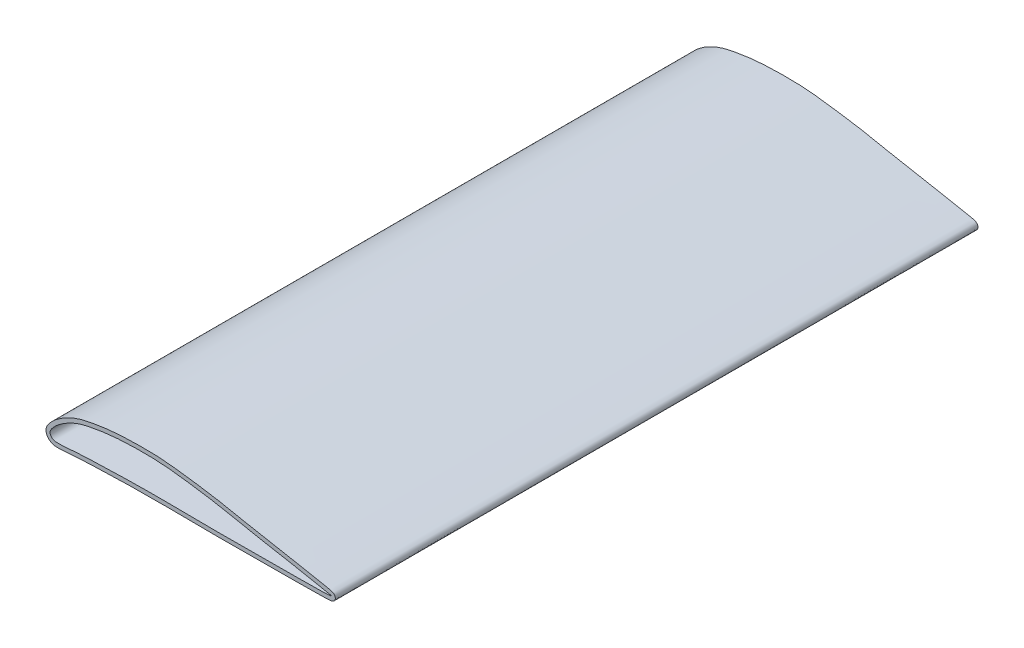
ISO-10303-21;
HEADER;
FILE_DESCRIPTION(('STEP AP214'),'2;1');
FILE_NAME('part.step','',(''),(''),'','','');
FILE_SCHEMA(('AUTOMOTIVE_DESIGN { 1 0 10303 214 1 1 1 1 }'));
ENDSEC;
DATA;
#1=APPLICATION_CONTEXT('core data for automotive mechanical design processes');
#2=APPLICATION_PROTOCOL_DEFINITION('international standard','automotive_design',2000,#1);
#3=PRODUCT_CONTEXT('',#1,'mechanical');
#4=PRODUCT('Part','Part','',(#3));
#5=PRODUCT_RELATED_PRODUCT_CATEGORY('part','',(#4));
#6=PRODUCT_DEFINITION_FORMATION('','',#4);
#7=PRODUCT_DEFINITION_CONTEXT('part definition',#1,'design');
#8=PRODUCT_DEFINITION('design','',#6,#7);
#9=PRODUCT_DEFINITION_SHAPE('','',#8);
#10=(LENGTH_UNIT() NAMED_UNIT(*) SI_UNIT(.MILLI.,.METRE.));
#11=(NAMED_UNIT(*) PLANE_ANGLE_UNIT() SI_UNIT($,.RADIAN.));
#12=(NAMED_UNIT(*) SI_UNIT($,.STERADIAN.) SOLID_ANGLE_UNIT());
#13=UNCERTAINTY_MEASURE_WITH_UNIT(LENGTH_MEASURE(1.E-05),#10,'distance_accuracy_value','');
#14=(GEOMETRIC_REPRESENTATION_CONTEXT(3) GLOBAL_UNCERTAINTY_ASSIGNED_CONTEXT((#13)) GLOBAL_UNIT_ASSIGNED_CONTEXT((#10,
#11,#12)) REPRESENTATION_CONTEXT('',''));
#15=CARTESIAN_POINT('',(0.,0.,0.));
#16=DIRECTION('',(0.,0.,1.));
#17=DIRECTION('',(1.,0.,0.));
#18=AXIS2_PLACEMENT_3D('',#15,#16,#17);
#19=CARTESIAN_POINT('',(-2.12770220526425,9.28546322944858,812.8));
#20=DIRECTION('',(0.,0.,-1.));
#21=DIRECTION('',(-1.,0.,0.));
#22=AXIS2_PLACEMENT_3D('',#19,#20,#21);
#23=PLANE('',#22);
#24=CARTESIAN_POINT('',(360.611783088414,-0.829716984691534,812.8));
#25=CARTESIAN_POINT('',(360.677516736931,-0.431769590755068,812.8));
#26=CARTESIAN_POINT('',(360.715012102294,0.39737776358076,812.8));
#27=CARTESIAN_POINT('',(360.421664380915,1.89734659052009,812.8));
#28=CARTESIAN_POINT('',(359.690517844514,3.17401205027613,812.8));
#29=CARTESIAN_POINT('',(358.918126768744,3.96508175282873,812.8));
#30=CARTESIAN_POINT('',(358.318267032827,4.42066290293129,812.8));
#31=CARTESIAN_POINT('',(357.843135950298,4.70927198930258,812.8));
#32=CARTESIAN_POINT('',(357.314769247348,4.98094514254315,812.8));
#33=CARTESIAN_POINT('',(356.769061674902,5.20760724953017,812.8));
#34=CARTESIAN_POINT('',(356.166361832082,5.41896649450408,812.8));
#35=CARTESIAN_POINT('',(355.564871973001,5.60295091670029,812.8));
#36=CARTESIAN_POINT('',(354.940172054753,5.77519661899665,812.8));
#37=CARTESIAN_POINT('',(354.062218077521,5.99777597210625,812.8));
#38=CARTESIAN_POINT('',(352.868144290553,6.27164418057462,812.8));
#39=CARTESIAN_POINT('',(351.281150812052,6.60345342509342,812.8));
#40=CARTESIAN_POINT('',(349.562200998619,6.93999659218324,812.8));
#41=CARTESIAN_POINT('',(347.7407484887,7.2805028361551,812.8));
#42=CARTESIAN_POINT('',(345.849846535147,7.62302316120932,812.8));
#43=CARTESIAN_POINT('',(343.284754246802,8.07888802212605,812.8));
#44=CARTESIAN_POINT('',(340.077278886889,8.64115010600491,812.8));
#45=CARTESIAN_POINT('',(336.581931789645,9.27338582575616,812.8));
#46=CARTESIAN_POINT('',(332.422020488974,10.0640645410946,812.8));
#47=CARTESIAN_POINT('',(327.903122178561,10.9777528968965,812.8));
#48=CARTESIAN_POINT('',(322.976471656021,12.0169837915886,812.8));
#49=CARTESIAN_POINT('',(317.864518336372,13.0643737721078,812.8));
#50=CARTESIAN_POINT('',(312.471448603847,14.1199230530068,812.8));
#51=CARTESIAN_POINT('',(306.892602428793,15.1792404595878,812.8));
#52=CARTESIAN_POINT('',(299.271359613369,16.5928128056946,812.8));
#53=CARTESIAN_POINT('',(289.539235870043,18.3555767649719,812.8));
#54=CARTESIAN_POINT('',(278.069145873182,20.4269138910801,812.8));
#55=CARTESIAN_POINT('',(266.889028325214,22.4813885575546,812.8));
#56=CARTESIAN_POINT('',(255.836169363417,24.5743857296795,812.8));
#57=CARTESIAN_POINT('',(241.119161142244,27.5041516765873,812.8));
#58=CARTESIAN_POINT('',(226.17771818306,30.6284955585057,812.8));
#59=CARTESIAN_POINT('',(211.073246752962,33.4503768288242,812.8));
#60=CARTESIAN_POINT('',(195.957402496639,35.9498185763177,812.8));
#61=CARTESIAN_POINT('',(177.127921344669,38.6597453231217,812.8));
#62=CARTESIAN_POINT('',(158.171643384304,41.2095808677918,812.8));
#63=CARTESIAN_POINT('',(142.799977726278,42.6172304733267,812.8));
#64=CARTESIAN_POINT('',(127.3617538442,43.4085128169304,812.8));
#65=CARTESIAN_POINT('',(111.9803158707,43.4046138855933,812.8));
#66=CARTESIAN_POINT('',(96.6348267084863,42.956517857911,812.8));
#67=CARTESIAN_POINT('',(85.0848707586515,42.3205909914167,812.8));
#68=CARTESIAN_POINT('',(73.531301514642,41.2765470192465,812.8));
#69=CARTESIAN_POINT('',(63.9313400403143,39.958908520291,812.8));
#70=CARTESIAN_POINT('',(56.3171155845465,38.6791030971168,812.8));
#71=CARTESIAN_POINT('',(50.6499497599874,37.6425202662996,812.8));
#72=CARTESIAN_POINT('',(44.9021633114431,36.4945120368245,812.8));
#73=CARTESIAN_POINT('',(39.1082915605699,35.0915992380378,812.8));
#74=CARTESIAN_POINT('',(33.2849324709737,33.2881291630142,812.8));
#75=CARTESIAN_POINT('',(27.6295600534796,30.9904600469647,812.8));
#76=CARTESIAN_POINT('',(22.2804118646765,28.4439820560217,812.8));
#77=CARTESIAN_POINT('',(17.0046326392783,25.6141861462535,812.8));
#78=CARTESIAN_POINT('',(11.8148958602526,22.3569422918749,812.8));
#79=CARTESIAN_POINT('',(7.67976623012431,19.2848085907363,812.8));
#80=CARTESIAN_POINT('',(4.59692601950477,16.635405025183,812.8));
#81=CARTESIAN_POINT('',(2.75896588536493,14.8760894966245,812.8));
#82=CARTESIAN_POINT('',(1.29550753139356,13.3542887541975,812.8));
#83=CARTESIAN_POINT('',(-0.163888759750838,11.7621121392498,812.8));
#84=CARTESIAN_POINT('',(-1.76422697415687,9.87346266874208,812.8));
#85=CARTESIAN_POINT('',(-3.25473722108047,7.6373019832347,812.8));
#86=CARTESIAN_POINT('',(-4.24628459349043,5.73495661624964,812.8));
#87=CARTESIAN_POINT('',(-5.00239928749968,3.53636937217703,812.8));
#88=CARTESIAN_POINT('',(-5.26736052713064,1.40326338643544,812.8));
#89=CARTESIAN_POINT('',(-5.12293710295604,-0.423499273381427,812.8));
#90=CARTESIAN_POINT('',(-4.69457004507471,-2.28179932337742,812.8));
#91=CARTESIAN_POINT('',(-3.75857745264617,-4.27625739479231,812.8));
#92=CARTESIAN_POINT('',(-2.25734351985861,-6.25985534644904,812.8));
#93=CARTESIAN_POINT('',(-0.464391315841216,-7.89542098064643,812.8));
#94=CARTESIAN_POINT('',(1.57959188809487,-9.2065616818801,812.8));
#95=CARTESIAN_POINT('',(3.94550239027525,-10.1218160695568,812.8));
#96=CARTESIAN_POINT('',(6.09493637855499,-10.5121842637663,812.8));
#97=CARTESIAN_POINT('',(7.97730648609706,-10.635362611475,812.8));
#98=CARTESIAN_POINT('',(9.51378006784479,-10.6559856217739,812.8));
#99=CARTESIAN_POINT('',(11.0416365883093,-10.6551970821441,812.8));
#100=CARTESIAN_POINT('',(12.5521230776529,-10.6243070079716,812.8));
#101=CARTESIAN_POINT('',(14.5465880708117,-10.5534600115824,812.8));
#102=CARTESIAN_POINT('',(17.0027877836702,-10.4174453262564,812.8));
#103=CARTESIAN_POINT('',(19.8949796055631,-10.2135180018431,812.8));
#104=CARTESIAN_POINT('',(22.7646933158898,-9.98881693717707,812.8));
#105=CARTESIAN_POINT('',(26.5530442008788,-9.67955193951272,812.8));
#106=CARTESIAN_POINT('',(31.2339877004447,-9.32155039401743,812.8));
#107=CARTESIAN_POINT('',(36.8687596815271,-8.95415187691269,812.8));
#108=CARTESIAN_POINT('',(42.5127093096359,-8.64234179615913,812.8));
#109=CARTESIAN_POINT('',(50.0612723083799,-8.28265032401868,812.8));
#110=CARTESIAN_POINT('',(59.5358879153629,-7.89049896565152,812.8));
#111=CARTESIAN_POINT('',(70.8921113057371,-7.47157703221145,812.8));
#112=CARTESIAN_POINT('',(82.2509482839475,-7.13095886237088,812.8));
#113=CARTESIAN_POINT('',(93.6164314430209,-6.85714543292889,812.8));
#114=CARTESIAN_POINT('',(108.778159596147,-6.57307460139264,812.8));
#115=CARTESIAN_POINT('',(127.732040417636,-6.33343496888481,812.8));
#116=CARTESIAN_POINT('',(150.425871859691,-6.39021215201501,812.8));
#117=CARTESIAN_POINT('',(173.21538765855,-6.75511670445447,812.8));
#118=CARTESIAN_POINT('',(196.045006315125,-6.93306279481234,812.8));
#119=CARTESIAN_POINT('',(218.881556020523,-6.93455837706369,812.8));
#120=CARTESIAN_POINT('',(237.963138188414,-6.84933351263652,812.8));
#121=CARTESIAN_POINT('',(253.08865728164,-6.71588183253142,812.8));
#122=CARTESIAN_POINT('',(264.367699993041,-6.59380460984213,812.8));
#123=CARTESIAN_POINT('',(275.720835372521,-6.48324674649998,812.8));
#124=CARTESIAN_POINT('',(287.295269893329,-6.41882566901398,812.8));
#125=CARTESIAN_POINT('',(297.162605658105,-6.41490960033031,812.8));
#126=CARTESIAN_POINT('',(304.922637869046,-6.40961902290395,812.8));
#127=CARTESIAN_POINT('',(310.619329753822,-6.39832852705022,812.8));
#128=CARTESIAN_POINT('',(316.140036270488,-6.37283305119357,812.8));
#129=CARTESIAN_POINT('',(321.398875956308,-6.32522505234369,812.8));
#130=CARTESIAN_POINT('',(326.448157730941,-6.2523331854654,812.8));
#131=CARTESIAN_POINT('',(331.035810080153,-6.18102850517306,812.8));
#132=CARTESIAN_POINT('',(335.22924779922,-6.12209407239269,812.8));
#133=CARTESIAN_POINT('',(338.726576785923,-6.07929615723084,812.8));
#134=CARTESIAN_POINT('',(342.605005677611,-6.03456860350175,812.8));
#135=CARTESIAN_POINT('',(345.867985865657,-5.97808396861637,812.8));
#136=CARTESIAN_POINT('',(348.354442671524,-5.91154090397633,812.8));
#137=CARTESIAN_POINT('',(350.122477671704,-5.8481026150487,812.8));
#138=CARTESIAN_POINT('',(351.763294974037,-5.767835834691,812.8));
#139=CARTESIAN_POINT('',(353.004865599127,-5.68325262398628,812.8));
#140=CARTESIAN_POINT('',(353.921088246468,-5.60050055122703,812.8));
#141=CARTESIAN_POINT('',(354.574012682801,-5.52847541831667,812.8));
#142=CARTESIAN_POINT('',(355.202262978684,-5.44239094592311,812.8));
#143=CARTESIAN_POINT('',(355.828436834357,-5.332491735066,812.8));
#144=CARTESIAN_POINT('',(356.387775071361,-5.20377185545108,812.8));
#145=CARTESIAN_POINT('',(356.91995574755,-5.04018073079652,812.8));
#146=CARTESIAN_POINT('',(357.393568000975,-4.86125929213146,812.8));
#147=CARTESIAN_POINT('',(357.991793491798,-4.57238551329047,812.8));
#148=CARTESIAN_POINT('',(358.783473470334,-4.05555403862709,812.8));
#149=CARTESIAN_POINT('',(359.660685696218,-3.18342196269986,812.8));
#150=CARTESIAN_POINT('',(360.32061021119,-1.99030660003803,812.8));
#151=CARTESIAN_POINT('',(360.546049439897,-1.22766437862788,812.8));
#152=CARTESIAN_POINT('',(360.611783088414,-0.829716984691534,812.8));
#153=B_SPLINE_CURVE_WITH_KNOTS('',3,(#24,#25,#26,#27,#28,#29,#30,#31,#32,#33,#34,#35,#36,#37,
#38,#39,#40,#41,#42,#43,#44,#45,#46,#47,#48,#49,#50,#51,#52,#53,#54,#55,#56,#57,#58,#59,#60,#61,
#62,#63,#64,#65,#66,#67,#68,#69,#70,#71,#72,#73,#74,#75,#76,#77,#78,#79,#80,#81,#82,#83,#84,#85,
#86,#87,#88,#89,#90,#91,#92,#93,#94,#95,#96,#97,#98,#99,#100,#101,#102,#103,#104,#105,#106,#107,
#108,#109,#110,#111,#112,#113,#114,#115,#116,#117,#118,#119,#120,#121,#122,#123,#124,#125,#126,
#127,#128,#129,#130,#131,#132,#133,#134,#135,#136,#137,#138,#139,#140,#141,#142,#143,#144,#145,
#146,#147,#148,#149,#150,#151,#152),.UNSPECIFIED.,.T.,.F.,(4,1,1,1,1,1,1,1,1,1,1,1,1,1,1,1,1,1,
1,1,1,1,1,1,1,1,1,1,1,1,1,1,1,1,1,1,1,1,1,1,1,1,1,1,1,1,1,1,1,1,1,1,1,1,1,1,1,1,1,1,1,1,1,1,1,1,
1,1,1,1,1,1,1,1,1,1,1,1,1,1,1,1,1,1,1,1,1,1,1,1,1,1,1,1,1,1,1,1,1,1,1,1,1,1,1,1,1,1,1,1,1,1,1,1,
1,1,1,1,1,1,1,1,1,1,1,1,4),(0.,0.000244140625,0.00048828125,0.0009765625,0.00146484375,
0.001953125,0.00244140625,0.0029296875,0.00390625,0.0048828125,0.005859375,0.0068359375,
0.0078125,0.009765625,0.01171875,0.013671875,0.015625,0.017578125,0.01953125,0.0234375,
0.02734375,0.03125,0.0390625,0.046875,0.0546875,0.0625,0.0703125,0.078125,0.09375,0.109375,
0.125,0.140625,0.15625,0.1875,0.203125,0.21875,0.25,0.28125,0.296875,0.3125,0.34375,0.359375,
0.375,0.390625,0.40625,0.4140625,0.421875,0.4296875,0.4375,0.4453125,0.453125,0.4609375,0.46875,
0.4765625,0.484375,0.48828125,0.4921875,0.494140625,0.49609375,0.5,0.501953125,0.50390625,
0.505859375,0.5078125,0.5087890625,0.509765625,0.51171875,0.513671875,0.515625,0.517578125,
0.51953125,0.521484375,0.5234375,0.525390625,0.52734375,0.529296875,0.53125,0.53515625,
0.5390625,0.54296875,0.546875,0.5546875,0.5625,0.5703125,0.578125,0.59375,0.609375,0.625,
0.640625,0.65625,0.6875,0.71875,0.75,0.78125,0.8125,0.84375,0.859375,0.875,0.890625,0.90625,
0.921875,0.9296875,0.9375,0.9453125,0.953125,0.9609375,0.96875,0.97265625,0.9765625,0.98046875,
0.984375,0.986328125,0.98828125,0.990234375,0.9921875,0.9931640625,0.994140625,0.9951171875,
0.99609375,0.9970703125,0.99755859375,0.998046875,0.99853515625,0.9990234375,0.99951171875,
0.999755859375,1.),.UNSPECIFIED.);
#154=CARTESIAN_POINT('',(360.611783088414,-0.829716984691534,812.8));
#155=VERTEX_POINT('',#154);
#156=EDGE_CURVE('E10',#155,#155,#153,.T.);
#157=ORIENTED_EDGE('',*,*,#156,.T.);
#158=EDGE_LOOP('',(#157));
#159=FACE_BOUND('',#158,.T.);
#160=CARTESIAN_POINT('',(355.6,0.,812.8));
#161=CARTESIAN_POINT('',(355.742662775557,0.861733457404024,812.8));
#162=CARTESIAN_POINT('',(335.067988759287,4.17789949988638,812.8));
#163=CARTESIAN_POINT('',(315.595899257123,8.51230052219543,812.8));
#164=CARTESIAN_POINT('',(283.755747478346,14.2150367655207,812.8));
#165=CARTESIAN_POINT('',(248.711891199437,20.6228502405481,812.8));
#166=CARTESIAN_POINT('',(213.099276813296,28.2960869760028,812.8));
#167=CARTESIAN_POINT('',(177.438860413867,33.5332802947491,812.8));
#168=CARTESIAN_POINT('',(141.86037480944,38.2674574653902,812.8));
#169=CARTESIAN_POINT('',(106.137977514781,38.4811659569359,812.8));
#170=CARTESIAN_POINT('',(76.3937240224355,36.903717850132,812.8));
#171=CARTESIAN_POINT('',(52.783057717719,32.9870860259043,812.8));
#172=CARTESIAN_POINT('',(37.7504416231908,29.8496160738291,812.8));
#173=CARTESIAN_POINT('',(26.1236794290295,24.7708508540007,812.8));
#174=CARTESIAN_POINT('',(17.1735407653483,19.9778051550387,812.8));
#175=CARTESIAN_POINT('',(9.67476995848276,14.5696321439262,812.8));
#176=CARTESIAN_POINT('',(3.4981725269177,8.49989483290762,812.8));
#177=CARTESIAN_POINT('',(-2.45147525088026,0.924296965716232,812.8));
#178=CARTESIAN_POINT('',(3.71206904824317,-5.34774951366373,812.8));
#179=CARTESIAN_POINT('',(10.4481354150685,-5.69217651558586,812.8));
#180=CARTESIAN_POINT('',(17.8595889965748,-5.314856424308,812.8));
#181=CARTESIAN_POINT('',(26.731491993828,-4.54928674538662,812.8));
#182=CARTESIAN_POINT('',(38.5676489300482,-3.71930596781918,812.8));
#183=CARTESIAN_POINT('',(53.3791209290981,-3.04398558245633,812.8));
#184=CARTESIAN_POINT('',(77.0722217050704,-2.13517549792576,812.8));
#185=CARTESIAN_POINT('',(106.69983098119,-1.46254157265574,812.8));
#186=CARTESIAN_POINT('',(142.260047782208,-1.1400189001601,812.8));
#187=CARTESIAN_POINT('',(177.831006446058,-1.78643895035578,812.8));
#188=CARTESIAN_POINT('',(213.348366865824,-1.8913487932747,812.8));
#189=CARTESIAN_POINT('',(249.080086592797,-1.72155060470322,812.8));
#190=CARTESIAN_POINT('',(283.988321231519,-1.25047218855206,812.8));
#191=CARTESIAN_POINT('',(315.634817831284,-1.39747633599044,812.8));
#192=CARTESIAN_POINT('',(335.235128281306,-1.00019432783944,812.8));
#193=CARTESIAN_POINT('',(355.460930634132,-0.840027996094049,812.8));
#194=CARTESIAN_POINT('',(355.6,0.,812.8));
#195=B_SPLINE_CURVE_WITH_KNOTS('',3,(#160,#161,#162,#163,#164,#165,#166,#167,#168,#169,#170,
#171,#172,#173,#174,#175,#176,#177,#178,#179,#180,#181,#182,#183,#184,#185,#186,#187,#188,#189,
#190,#191,#192,#193,#194),.UNSPECIFIED.,.T.,.F.,(4,1,1,1,1,1,1,1,1,1,1,1,1,1,1,1,1,1,1,1,1,1,1,
1,1,1,1,1,1,1,1,1,4),(0.,0.025026287291907,0.0499520617534605,0.0996838098417098,
0.149415557929959,0.199258543548913,0.248703056455884,0.297849082099681,0.346623035466671,
0.395438522152419,0.420070941928227,0.445103861606754,0.458263471856863,0.472049530181497,
0.487005631683779,0.495455170409994,0.509298808795639,0.518413363916536,0.524589236670762,
0.536779457562765,0.548989568108669,0.561192853063547,0.585584554925768,0.60996344954126,
0.658714952490805,0.707463407069837,0.75622836274545,0.804980995286651,0.853733783102001,
0.902478123236492,0.951230530787744,0.975604078287936,1.),.UNSPECIFIED.);
#196=CARTESIAN_POINT('',(355.6,0.,812.8));
#197=VERTEX_POINT('',#196);
#198=EDGE_CURVE('E45',#197,#197,#195,.T.);
#199=ORIENTED_EDGE('',*,*,#198,.F.);
#200=EDGE_LOOP('',(#199));
#201=FACE_BOUND('',#200,.T.);
#202=ADVANCED_FACE('F32',(#159,#201),#23,.F.);
#203=CARTESIAN_POINT('',(-2.12770220526425,9.28546322944858,0.));
#204=DIRECTION('',(0.,0.,-1.));
#205=DIRECTION('',(-1.,0.,0.));
#206=AXIS2_PLACEMENT_3D('',#203,#204,#205);
#207=PLANE('',#206);
#208=CARTESIAN_POINT('',(360.611783088414,-0.829716984691534,0.));
#209=CARTESIAN_POINT('',(360.677516736931,-0.431769590755068,0.));
#210=CARTESIAN_POINT('',(360.715012102294,0.39737776358076,0.));
#211=CARTESIAN_POINT('',(360.421664380915,1.89734659052009,0.));
#212=CARTESIAN_POINT('',(359.690517844514,3.17401205027613,0.));
#213=CARTESIAN_POINT('',(358.918126768744,3.96508175282873,0.));
#214=CARTESIAN_POINT('',(358.318267032827,4.42066290293129,0.));
#215=CARTESIAN_POINT('',(357.843135950298,4.70927198930258,0.));
#216=CARTESIAN_POINT('',(357.314769247348,4.98094514254315,0.));
#217=CARTESIAN_POINT('',(356.769061674902,5.20760724953017,0.));
#218=CARTESIAN_POINT('',(356.166361832082,5.41896649450408,0.));
#219=CARTESIAN_POINT('',(355.564871973001,5.60295091670029,0.));
#220=CARTESIAN_POINT('',(354.940172054753,5.77519661899665,0.));
#221=CARTESIAN_POINT('',(354.062218077521,5.99777597210625,0.));
#222=CARTESIAN_POINT('',(352.868144290553,6.27164418057462,0.));
#223=CARTESIAN_POINT('',(351.281150812052,6.60345342509342,0.));
#224=CARTESIAN_POINT('',(349.562200998619,6.93999659218324,0.));
#225=CARTESIAN_POINT('',(347.7407484887,7.2805028361551,0.));
#226=CARTESIAN_POINT('',(345.849846535147,7.62302316120932,0.));
#227=CARTESIAN_POINT('',(343.284754246802,8.07888802212605,0.));
#228=CARTESIAN_POINT('',(340.077278886889,8.64115010600491,0.));
#229=CARTESIAN_POINT('',(336.581931789645,9.27338582575616,0.));
#230=CARTESIAN_POINT('',(332.422020488974,10.0640645410946,0.));
#231=CARTESIAN_POINT('',(327.903122178561,10.9777528968965,0.));
#232=CARTESIAN_POINT('',(322.976471656021,12.0169837915886,0.));
#233=CARTESIAN_POINT('',(317.864518336372,13.0643737721078,0.));
#234=CARTESIAN_POINT('',(312.471448603847,14.1199230530068,0.));
#235=CARTESIAN_POINT('',(306.892602428793,15.1792404595878,0.));
#236=CARTESIAN_POINT('',(299.271359613369,16.5928128056946,0.));
#237=CARTESIAN_POINT('',(289.539235870043,18.3555767649719,0.));
#238=CARTESIAN_POINT('',(278.069145873182,20.4269138910801,0.));
#239=CARTESIAN_POINT('',(266.889028325214,22.4813885575546,0.));
#240=CARTESIAN_POINT('',(255.836169363417,24.5743857296795,0.));
#241=CARTESIAN_POINT('',(241.119161142244,27.5041516765873,0.));
#242=CARTESIAN_POINT('',(226.17771818306,30.6284955585057,0.));
#243=CARTESIAN_POINT('',(211.073246752962,33.4503768288242,0.));
#244=CARTESIAN_POINT('',(195.957402496639,35.9498185763177,0.));
#245=CARTESIAN_POINT('',(177.127921344669,38.6597453231217,0.));
#246=CARTESIAN_POINT('',(158.171643384304,41.2095808677918,0.));
#247=CARTESIAN_POINT('',(142.799977726278,42.6172304733267,0.));
#248=CARTESIAN_POINT('',(127.3617538442,43.4085128169304,0.));
#249=CARTESIAN_POINT('',(111.9803158707,43.4046138855933,0.));
#250=CARTESIAN_POINT('',(96.6348267084863,42.956517857911,0.));
#251=CARTESIAN_POINT('',(85.0848707586515,42.3205909914167,0.));
#252=CARTESIAN_POINT('',(73.531301514642,41.2765470192465,0.));
#253=CARTESIAN_POINT('',(63.9313400403143,39.958908520291,0.));
#254=CARTESIAN_POINT('',(56.3171155845465,38.6791030971168,0.));
#255=CARTESIAN_POINT('',(50.6499497599874,37.6425202662996,0.));
#256=CARTESIAN_POINT('',(44.9021633114431,36.4945120368245,0.));
#257=CARTESIAN_POINT('',(39.1082915605699,35.0915992380378,0.));
#258=CARTESIAN_POINT('',(33.2849324709737,33.2881291630142,0.));
#259=CARTESIAN_POINT('',(27.6295600534796,30.9904600469647,0.));
#260=CARTESIAN_POINT('',(22.2804118646765,28.4439820560217,0.));
#261=CARTESIAN_POINT('',(17.0046326392783,25.6141861462535,0.));
#262=CARTESIAN_POINT('',(11.8148958602526,22.3569422918749,0.));
#263=CARTESIAN_POINT('',(7.67976623012431,19.2848085907363,0.));
#264=CARTESIAN_POINT('',(4.59692601950477,16.635405025183,0.));
#265=CARTESIAN_POINT('',(2.75896588536493,14.8760894966245,0.));
#266=CARTESIAN_POINT('',(1.29550753139356,13.3542887541975,0.));
#267=CARTESIAN_POINT('',(-0.163888759750838,11.7621121392498,0.));
#268=CARTESIAN_POINT('',(-1.76422697415687,9.87346266874208,0.));
#269=CARTESIAN_POINT('',(-3.25473722108047,7.6373019832347,0.));
#270=CARTESIAN_POINT('',(-4.24628459349043,5.73495661624964,0.));
#271=CARTESIAN_POINT('',(-5.00239928749968,3.53636937217703,0.));
#272=CARTESIAN_POINT('',(-5.26736052713064,1.40326338643544,0.));
#273=CARTESIAN_POINT('',(-5.12293710295604,-0.423499273381427,0.));
#274=CARTESIAN_POINT('',(-4.69457004507471,-2.28179932337742,0.));
#275=CARTESIAN_POINT('',(-3.75857745264617,-4.27625739479231,0.));
#276=CARTESIAN_POINT('',(-2.25734351985861,-6.25985534644904,0.));
#277=CARTESIAN_POINT('',(-0.464391315841216,-7.89542098064643,0.));
#278=CARTESIAN_POINT('',(1.57959188809487,-9.2065616818801,0.));
#279=CARTESIAN_POINT('',(3.94550239027525,-10.1218160695568,0.));
#280=CARTESIAN_POINT('',(6.09493637855499,-10.5121842637663,0.));
#281=CARTESIAN_POINT('',(7.97730648609706,-10.635362611475,0.));
#282=CARTESIAN_POINT('',(9.51378006784479,-10.6559856217739,0.));
#283=CARTESIAN_POINT('',(11.0416365883093,-10.6551970821441,0.));
#284=CARTESIAN_POINT('',(12.5521230776529,-10.6243070079716,0.));
#285=CARTESIAN_POINT('',(14.5465880708117,-10.5534600115824,0.));
#286=CARTESIAN_POINT('',(17.0027877836702,-10.4174453262564,0.));
#287=CARTESIAN_POINT('',(19.8949796055631,-10.2135180018431,0.));
#288=CARTESIAN_POINT('',(22.7646933158898,-9.98881693717707,0.));
#289=CARTESIAN_POINT('',(26.5530442008788,-9.67955193951272,0.));
#290=CARTESIAN_POINT('',(31.2339877004447,-9.32155039401743,0.));
#291=CARTESIAN_POINT('',(36.8687596815271,-8.95415187691269,0.));
#292=CARTESIAN_POINT('',(42.5127093096359,-8.64234179615913,0.));
#293=CARTESIAN_POINT('',(50.0612723083799,-8.28265032401868,0.));
#294=CARTESIAN_POINT('',(59.5358879153629,-7.89049896565152,0.));
#295=CARTESIAN_POINT('',(70.8921113057371,-7.47157703221145,0.));
#296=CARTESIAN_POINT('',(82.2509482839475,-7.13095886237088,0.));
#297=CARTESIAN_POINT('',(93.6164314430209,-6.85714543292889,0.));
#298=CARTESIAN_POINT('',(108.778159596147,-6.57307460139264,0.));
#299=CARTESIAN_POINT('',(127.732040417636,-6.33343496888481,0.));
#300=CARTESIAN_POINT('',(150.425871859691,-6.39021215201501,0.));
#301=CARTESIAN_POINT('',(173.21538765855,-6.75511670445447,0.));
#302=CARTESIAN_POINT('',(196.045006315125,-6.93306279481234,0.));
#303=CARTESIAN_POINT('',(218.881556020523,-6.93455837706369,0.));
#304=CARTESIAN_POINT('',(237.963138188414,-6.84933351263652,0.));
#305=CARTESIAN_POINT('',(253.08865728164,-6.71588183253142,0.));
#306=CARTESIAN_POINT('',(264.367699993041,-6.59380460984213,0.));
#307=CARTESIAN_POINT('',(275.720835372521,-6.48324674649998,0.));
#308=CARTESIAN_POINT('',(287.295269893329,-6.41882566901398,0.));
#309=CARTESIAN_POINT('',(297.162605658105,-6.41490960033031,0.));
#310=CARTESIAN_POINT('',(304.922637869046,-6.40961902290395,0.));
#311=CARTESIAN_POINT('',(310.619329753822,-6.39832852705022,0.));
#312=CARTESIAN_POINT('',(316.140036270488,-6.37283305119357,0.));
#313=CARTESIAN_POINT('',(321.398875956308,-6.32522505234369,0.));
#314=CARTESIAN_POINT('',(326.448157730941,-6.2523331854654,0.));
#315=CARTESIAN_POINT('',(331.035810080153,-6.18102850517306,0.));
#316=CARTESIAN_POINT('',(335.22924779922,-6.12209407239269,0.));
#317=CARTESIAN_POINT('',(338.726576785923,-6.07929615723084,0.));
#318=CARTESIAN_POINT('',(342.605005677611,-6.03456860350175,0.));
#319=CARTESIAN_POINT('',(345.867985865657,-5.97808396861637,0.));
#320=CARTESIAN_POINT('',(348.354442671524,-5.91154090397633,0.));
#321=CARTESIAN_POINT('',(350.122477671704,-5.8481026150487,0.));
#322=CARTESIAN_POINT('',(351.763294974037,-5.767835834691,0.));
#323=CARTESIAN_POINT('',(353.004865599127,-5.68325262398628,0.));
#324=CARTESIAN_POINT('',(353.921088246468,-5.60050055122703,0.));
#325=CARTESIAN_POINT('',(354.574012682801,-5.52847541831667,0.));
#326=CARTESIAN_POINT('',(355.202262978684,-5.44239094592311,0.));
#327=CARTESIAN_POINT('',(355.828436834357,-5.332491735066,0.));
#328=CARTESIAN_POINT('',(356.387775071361,-5.20377185545108,0.));
#329=CARTESIAN_POINT('',(356.91995574755,-5.04018073079652,0.));
#330=CARTESIAN_POINT('',(357.393568000975,-4.86125929213146,0.));
#331=CARTESIAN_POINT('',(357.991793491798,-4.57238551329047,0.));
#332=CARTESIAN_POINT('',(358.783473470334,-4.05555403862709,0.));
#333=CARTESIAN_POINT('',(359.660685696218,-3.18342196269986,0.));
#334=CARTESIAN_POINT('',(360.32061021119,-1.99030660003803,0.));
#335=CARTESIAN_POINT('',(360.546049439897,-1.22766437862788,0.));
#336=CARTESIAN_POINT('',(360.611783088414,-0.829716984691534,0.));
#337=B_SPLINE_CURVE_WITH_KNOTS('',3,(#208,#209,#210,#211,#212,#213,#214,#215,#216,#217,#218,
#219,#220,#221,#222,#223,#224,#225,#226,#227,#228,#229,#230,#231,#232,#233,#234,#235,#236,#237,
#238,#239,#240,#241,#242,#243,#244,#245,#246,#247,#248,#249,#250,#251,#252,#253,#254,#255,#256,
#257,#258,#259,#260,#261,#262,#263,#264,#265,#266,#267,#268,#269,#270,#271,#272,#273,#274,#275,
#276,#277,#278,#279,#280,#281,#282,#283,#284,#285,#286,#287,#288,#289,#290,#291,#292,#293,#294,
#295,#296,#297,#298,#299,#300,#301,#302,#303,#304,#305,#306,#307,#308,#309,#310,#311,#312,#313,
#314,#315,#316,#317,#318,#319,#320,#321,#322,#323,#324,#325,#326,#327,#328,#329,#330,#331,#332,
#333,#334,#335,#336),.UNSPECIFIED.,.T.,.F.,(4,1,1,1,1,1,1,1,1,1,1,1,1,1,1,1,1,1,1,1,1,1,1,1,1,1,
1,1,1,1,1,1,1,1,1,1,1,1,1,1,1,1,1,1,1,1,1,1,1,1,1,1,1,1,1,1,1,1,1,1,1,1,1,1,1,1,1,1,1,1,1,1,1,1,
1,1,1,1,1,1,1,1,1,1,1,1,1,1,1,1,1,1,1,1,1,1,1,1,1,1,1,1,1,1,1,1,1,1,1,1,1,1,1,1,1,1,1,1,1,1,1,1,
1,1,1,1,4),(0.,0.000244140625,0.00048828125,0.0009765625,0.00146484375,0.001953125,
0.00244140625,0.0029296875,0.00390625,0.0048828125,0.005859375,0.0068359375,0.0078125,
0.009765625,0.01171875,0.013671875,0.015625,0.017578125,0.01953125,0.0234375,0.02734375,0.03125,
0.0390625,0.046875,0.0546875,0.0625,0.0703125,0.078125,0.09375,0.109375,0.125,0.140625,0.15625,
0.1875,0.203125,0.21875,0.25,0.28125,0.296875,0.3125,0.34375,0.359375,0.375,0.390625,0.40625,
0.4140625,0.421875,0.4296875,0.4375,0.4453125,0.453125,0.4609375,0.46875,0.4765625,0.484375,
0.48828125,0.4921875,0.494140625,0.49609375,0.5,0.501953125,0.50390625,0.505859375,0.5078125,
0.5087890625,0.509765625,0.51171875,0.513671875,0.515625,0.517578125,0.51953125,0.521484375,
0.5234375,0.525390625,0.52734375,0.529296875,0.53125,0.53515625,0.5390625,0.54296875,0.546875,
0.5546875,0.5625,0.5703125,0.578125,0.59375,0.609375,0.625,0.640625,0.65625,0.6875,0.71875,0.75,
0.78125,0.8125,0.84375,0.859375,0.875,0.890625,0.90625,0.921875,0.9296875,0.9375,0.9453125,
0.953125,0.9609375,0.96875,0.97265625,0.9765625,0.98046875,0.984375,0.986328125,0.98828125,
0.990234375,0.9921875,0.9931640625,0.994140625,0.9951171875,0.99609375,0.9970703125,
0.99755859375,0.998046875,0.99853515625,0.9990234375,0.99951171875,0.999755859375,1.),.UNSPECIFIED.);
#338=CARTESIAN_POINT('',(360.611783088414,-0.829716984691534,0.));
#339=VERTEX_POINT('',#338);
#340=EDGE_CURVE('E37',#339,#339,#337,.T.);
#341=ORIENTED_EDGE('',*,*,#340,.F.);
#342=EDGE_LOOP('',(#341));
#343=FACE_BOUND('',#342,.T.);
#344=CARTESIAN_POINT('',(355.6,0.,0.));
#345=CARTESIAN_POINT('',(355.742662775557,0.861733457404024,0.));
#346=CARTESIAN_POINT('',(335.067988759287,4.17789949988638,0.));
#347=CARTESIAN_POINT('',(315.595899257123,8.51230052219543,0.));
#348=CARTESIAN_POINT('',(283.755747478346,14.2150367655207,0.));
#349=CARTESIAN_POINT('',(248.711891199437,20.6228502405481,0.));
#350=CARTESIAN_POINT('',(213.099276813296,28.2960869760028,0.));
#351=CARTESIAN_POINT('',(177.438860413867,33.5332802947491,0.));
#352=CARTESIAN_POINT('',(141.86037480944,38.2674574653902,0.));
#353=CARTESIAN_POINT('',(106.137977514781,38.4811659569359,0.));
#354=CARTESIAN_POINT('',(76.3937240224355,36.903717850132,0.));
#355=CARTESIAN_POINT('',(52.783057717719,32.9870860259043,0.));
#356=CARTESIAN_POINT('',(37.7504416231908,29.8496160738291,0.));
#357=CARTESIAN_POINT('',(26.1236794290295,24.7708508540007,0.));
#358=CARTESIAN_POINT('',(17.1735407653483,19.9778051550387,0.));
#359=CARTESIAN_POINT('',(9.67476995848276,14.5696321439262,0.));
#360=CARTESIAN_POINT('',(3.4981725269177,8.49989483290762,0.));
#361=CARTESIAN_POINT('',(-2.45147525088026,0.924296965716232,0.));
#362=CARTESIAN_POINT('',(3.71206904824317,-5.34774951366373,0.));
#363=CARTESIAN_POINT('',(10.4481354150685,-5.69217651558586,0.));
#364=CARTESIAN_POINT('',(17.8595889965748,-5.314856424308,0.));
#365=CARTESIAN_POINT('',(26.731491993828,-4.54928674538662,0.));
#366=CARTESIAN_POINT('',(38.5676489300482,-3.71930596781918,0.));
#367=CARTESIAN_POINT('',(53.3791209290981,-3.04398558245633,0.));
#368=CARTESIAN_POINT('',(77.0722217050704,-2.13517549792576,0.));
#369=CARTESIAN_POINT('',(106.69983098119,-1.46254157265574,0.));
#370=CARTESIAN_POINT('',(142.260047782208,-1.1400189001601,0.));
#371=CARTESIAN_POINT('',(177.831006446058,-1.78643895035578,0.));
#372=CARTESIAN_POINT('',(213.348366865824,-1.8913487932747,0.));
#373=CARTESIAN_POINT('',(249.080086592797,-1.72155060470322,0.));
#374=CARTESIAN_POINT('',(283.988321231519,-1.25047218855206,0.));
#375=CARTESIAN_POINT('',(315.634817831284,-1.39747633599044,0.));
#376=CARTESIAN_POINT('',(335.235128281306,-1.00019432783944,0.));
#377=CARTESIAN_POINT('',(355.460930634132,-0.840027996094049,0.));
#378=CARTESIAN_POINT('',(355.6,0.,0.));
#379=B_SPLINE_CURVE_WITH_KNOTS('',3,(#344,#345,#346,#347,#348,#349,#350,#351,#352,#353,#354,
#355,#356,#357,#358,#359,#360,#361,#362,#363,#364,#365,#366,#367,#368,#369,#370,#371,#372,#373,
#374,#375,#376,#377,#378),.UNSPECIFIED.,.T.,.F.,(4,1,1,1,1,1,1,1,1,1,1,1,1,1,1,1,1,1,1,1,1,1,1,
1,1,1,1,1,1,1,1,1,4),(0.,0.025026287291907,0.0499520617534605,0.0996838098417098,
0.149415557929959,0.199258543548913,0.248703056455884,0.297849082099681,0.346623035466671,
0.395438522152419,0.420070941928227,0.445103861606754,0.458263471856863,0.472049530181497,
0.487005631683779,0.495455170409994,0.509298808795639,0.518413363916536,0.524589236670762,
0.536779457562765,0.548989568108669,0.561192853063547,0.585584554925768,0.60996344954126,
0.658714952490805,0.707463407069837,0.75622836274545,0.804980995286651,0.853733783102001,
0.902478123236492,0.951230530787744,0.975604078287936,1.),.UNSPECIFIED.);
#380=CARTESIAN_POINT('',(355.6,0.,0.));
#381=VERTEX_POINT('',#380);
#382=EDGE_CURVE('E50',#381,#381,#379,.T.);
#383=ORIENTED_EDGE('',*,*,#382,.T.);
#384=EDGE_LOOP('',(#383));
#385=FACE_BOUND('',#384,.T.);
#386=ADVANCED_FACE('F74',(#343,#385),#207,.T.);
#387=DIRECTION('',(0.,0.,-1.));
#388=VECTOR('',#387,1.);
#389=SURFACE_OF_LINEAR_EXTRUSION('',#153,#388);
#390=ORIENTED_EDGE('',*,*,#156,.F.);
#391=EDGE_LOOP('',(#390));
#392=FACE_BOUND('',#391,.T.);
#393=ORIENTED_EDGE('',*,*,#340,.T.);
#394=EDGE_LOOP('',(#393));
#395=FACE_BOUND('',#394,.T.);
#396=ADVANCED_FACE('F34',(#392,#395),#389,.F.);
#397=DIRECTION('',(0.,0.,-1.));
#398=VECTOR('',#397,1.);
#399=SURFACE_OF_LINEAR_EXTRUSION('',#195,#398);
#400=ORIENTED_EDGE('',*,*,#198,.T.);
#401=EDGE_LOOP('',(#400));
#402=FACE_BOUND('',#401,.T.);
#403=ORIENTED_EDGE('',*,*,#382,.F.);
#404=EDGE_LOOP('',(#403));
#405=FACE_BOUND('',#404,.T.);
#406=ADVANCED_FACE('F69',(#402,#405),#399,.T.);
#407=CLOSED_SHELL('',(#202,#386,#396,#406));
#408=MANIFOLD_SOLID_BREP('B2',#407);
#409=ADVANCED_BREP_SHAPE_REPRESENTATION('',(#18,#408),#14);
#410=SHAPE_DEFINITION_REPRESENTATION(#9,#409);
ENDSEC;
END-ISO-10303-21;
